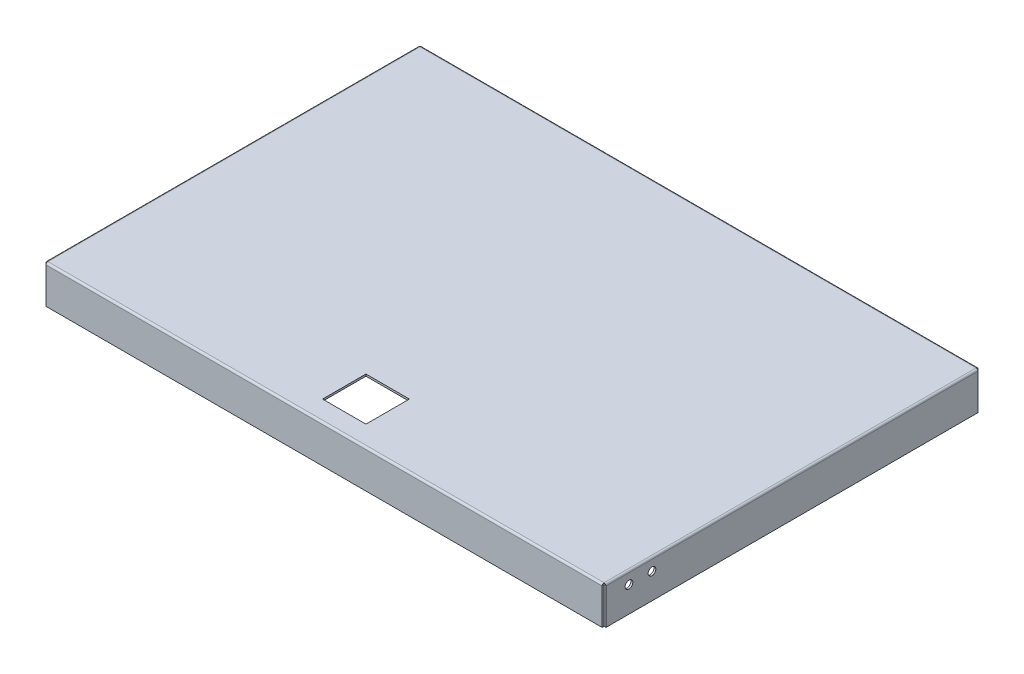
ISO-10303-21;
HEADER;
FILE_DESCRIPTION(('STEP AP214'),'2;1');
FILE_NAME('part.step','',(''),(''),'','','');
FILE_SCHEMA(('AUTOMOTIVE_DESIGN { 1 0 10303 214 1 1 1 1 }'));
ENDSEC;
DATA;
#1=APPLICATION_CONTEXT('core data for automotive mechanical design processes');
#2=APPLICATION_PROTOCOL_DEFINITION('international standard','automotive_design',2000,#1);
#3=PRODUCT_CONTEXT('',#1,'mechanical');
#4=PRODUCT('Part','Part','',(#3));
#5=PRODUCT_RELATED_PRODUCT_CATEGORY('part','',(#4));
#6=PRODUCT_DEFINITION_FORMATION('','',#4);
#7=PRODUCT_DEFINITION_CONTEXT('part definition',#1,'design');
#8=PRODUCT_DEFINITION('design','',#6,#7);
#9=PRODUCT_DEFINITION_SHAPE('','',#8);
#10=(LENGTH_UNIT() NAMED_UNIT(*) SI_UNIT(.MILLI.,.METRE.));
#11=(NAMED_UNIT(*) PLANE_ANGLE_UNIT() SI_UNIT($,.RADIAN.));
#12=(NAMED_UNIT(*) SI_UNIT($,.STERADIAN.) SOLID_ANGLE_UNIT());
#13=UNCERTAINTY_MEASURE_WITH_UNIT(LENGTH_MEASURE(1.E-05),#10,'distance_accuracy_value','');
#14=(GEOMETRIC_REPRESENTATION_CONTEXT(3) GLOBAL_UNCERTAINTY_ASSIGNED_CONTEXT((#13)) GLOBAL_UNIT_ASSIGNED_CONTEXT((#10,
#11,#12)) REPRESENTATION_CONTEXT('',''));
#15=CARTESIAN_POINT('',(0.,0.,0.));
#16=DIRECTION('',(0.,0.,1.));
#17=DIRECTION('',(1.,0.,0.));
#18=AXIS2_PLACEMENT_3D('',#15,#16,#17);
#19=CARTESIAN_POINT('',(923.925,59.4,0.));
#20=DIRECTION('',(-1.,0.,0.));
#21=DIRECTION('',(0.,0.,1.));
#22=AXIS2_PLACEMENT_3D('',#19,#20,#21);
#23=PLANE('',#22);
#24=CARTESIAN_POINT('',(923.925,42.4,-38.1));
#25=DIRECTION('',(1.,0.,0.));
#26=DIRECTION('',(0.,0.,-1.));
#27=AXIS2_PLACEMENT_3D('',#24,#25,#26);
#28=CIRCLE('',#27,6.35000000000001);
#29=CARTESIAN_POINT('',(923.925,42.4,-44.45));
#30=VERTEX_POINT('',#29);
#31=EDGE_CURVE('E126',#30,#30,#28,.T.);
#32=ORIENTED_EDGE('',*,*,#31,.F.);
#33=EDGE_LOOP('',(#32));
#34=FACE_BOUND('',#33,.T.);
#35=CARTESIAN_POINT('',(923.925,42.4,-76.2));
#36=DIRECTION('',(1.,0.,0.));
#37=DIRECTION('',(0.,0.,-1.));
#38=AXIS2_PLACEMENT_3D('',#35,#36,#37);
#39=CIRCLE('',#38,6.35000000000001);
#40=CARTESIAN_POINT('',(923.925,42.4,-82.55));
#41=VERTEX_POINT('',#40);
#42=EDGE_CURVE('E127',#41,#41,#39,.T.);
#43=ORIENTED_EDGE('',*,*,#42,.F.);
#44=EDGE_LOOP('',(#43));
#45=FACE_BOUND('',#44,.T.);
#46=DIRECTION('',(0.,0.,-1.));
#47=VECTOR('',#46,1.);
#48=CARTESIAN_POINT('',(923.925,0.,0.));
#49=LINE('',#48,#47);
#50=CARTESIAN_POINT('',(923.925,0.,0.));
#51=VERTEX_POINT('',#50);
#52=CARTESIAN_POINT('',(923.925,0.,-615.95));
#53=VERTEX_POINT('',#52);
#54=EDGE_CURVE('E111',#51,#53,#49,.T.);
#55=ORIENTED_EDGE('',*,*,#54,.T.);
#56=DIRECTION('',(0.,-1.,0.));
#57=VECTOR('',#56,1.);
#58=CARTESIAN_POINT('',(923.925,59.4,-615.95));
#59=LINE('',#58,#57);
#60=CARTESIAN_POINT('',(923.925,59.4,-615.95));
#61=VERTEX_POINT('',#60);
#62=EDGE_CURVE('E12',#61,#53,#59,.T.);
#63=ORIENTED_EDGE('',*,*,#62,.F.);
#64=DIRECTION('',(0.,0.,-1.));
#65=VECTOR('',#64,1.);
#66=CARTESIAN_POINT('',(923.925,59.4,0.));
#67=LINE('',#66,#65);
#68=CARTESIAN_POINT('',(923.925,59.4,0.));
#69=VERTEX_POINT('',#68);
#70=EDGE_CURVE('E97',#69,#61,#67,.T.);
#71=ORIENTED_EDGE('',*,*,#70,.F.);
#72=DIRECTION('',(0.,-1.,0.));
#73=VECTOR('',#72,1.);
#74=CARTESIAN_POINT('',(923.925,59.4,0.));
#75=LINE('',#74,#73);
#76=EDGE_CURVE('E64',#69,#51,#75,.T.);
#77=ORIENTED_EDGE('',*,*,#76,.T.);
#78=EDGE_LOOP('',(#55,#63,#71,#77));
#79=FACE_BOUND('',#78,.T.);
#80=ADVANCED_FACE('F48',(#34,#45,#79),#23,.F.);
#81=CARTESIAN_POINT('',(0.,59.4,-615.95));
#82=DIRECTION('',(0.,0.,1.));
#83=DIRECTION('',(1.,0.,0.));
#84=AXIS2_PLACEMENT_3D('',#81,#82,#83);
#85=PLANE('',#84);
#86=DIRECTION('',(-1.,0.,0.));
#87=VECTOR('',#86,1.);
#88=CARTESIAN_POINT('',(0.,0.,-615.95));
#89=LINE('',#88,#87);
#90=CARTESIAN_POINT('',(920.75,0.,-615.95));
#91=VERTEX_POINT('',#90);
#92=EDGE_CURVE('E102',#53,#91,#89,.T.);
#93=ORIENTED_EDGE('',*,*,#92,.T.);
#94=DIRECTION('',(0.,-1.,0.));
#95=VECTOR('',#94,1.);
#96=CARTESIAN_POINT('',(920.75,59.4,-615.95));
#97=LINE('',#96,#95);
#98=CARTESIAN_POINT('',(920.75,59.4,-615.95));
#99=VERTEX_POINT('',#98);
#100=EDGE_CURVE('E56',#99,#91,#97,.T.);
#101=ORIENTED_EDGE('',*,*,#100,.F.);
#102=DIRECTION('',(-1.,0.,0.));
#103=VECTOR('',#102,1.);
#104=CARTESIAN_POINT('',(0.,59.4,-615.95));
#105=LINE('',#104,#103);
#106=EDGE_CURVE('E89',#61,#99,#105,.T.);
#107=ORIENTED_EDGE('',*,*,#106,.F.);
#108=ORIENTED_EDGE('',*,*,#62,.T.);
#109=EDGE_LOOP('',(#93,#101,#107,#108));
#110=FACE_BOUND('',#109,.T.);
#111=ADVANCED_FACE('F101',(#110),#85,.F.);
#112=CARTESIAN_POINT('',(920.75,59.4,0.));
#113=DIRECTION('',(-1.,0.,0.));
#114=DIRECTION('',(0.,0.,1.));
#115=AXIS2_PLACEMENT_3D('',#112,#113,#114);
#116=PLANE('',#115);
#117=CARTESIAN_POINT('',(920.75,42.4,-38.1));
#118=DIRECTION('',(-1.,0.,0.));
#119=DIRECTION('',(0.,0.,1.));
#120=AXIS2_PLACEMENT_3D('',#117,#118,#119);
#121=CIRCLE('',#120,6.35000000000001);
#122=CARTESIAN_POINT('',(920.75,42.4,-31.75));
#123=VERTEX_POINT('',#122);
#124=EDGE_CURVE('E113',#123,#123,#121,.F.);
#125=ORIENTED_EDGE('',*,*,#124,.T.);
#126=EDGE_LOOP('',(#125));
#127=FACE_BOUND('',#126,.T.);
#128=CARTESIAN_POINT('',(920.75,42.4,-76.2));
#129=DIRECTION('',(-1.,0.,0.));
#130=DIRECTION('',(0.,0.,1.));
#131=AXIS2_PLACEMENT_3D('',#128,#129,#130);
#132=CIRCLE('',#131,6.35000000000001);
#133=CARTESIAN_POINT('',(920.75,42.4,-69.85));
#134=VERTEX_POINT('',#133);
#135=EDGE_CURVE('E123',#134,#134,#132,.F.);
#136=ORIENTED_EDGE('',*,*,#135,.T.);
#137=EDGE_LOOP('',(#136));
#138=FACE_BOUND('',#137,.T.);
#139=DIRECTION('',(0.,0.,-1.));
#140=VECTOR('',#139,1.);
#141=CARTESIAN_POINT('',(920.75,0.,0.));
#142=LINE('',#141,#140);
#143=CARTESIAN_POINT('',(920.75,0.,0.));
#144=VERTEX_POINT('',#143);
#145=EDGE_CURVE('E115',#144,#91,#142,.T.);
#146=ORIENTED_EDGE('',*,*,#145,.F.);
#147=DIRECTION('',(0.,-1.,0.));
#148=VECTOR('',#147,1.);
#149=CARTESIAN_POINT('',(920.75,59.4,0.));
#150=LINE('',#149,#148);
#151=CARTESIAN_POINT('',(920.75,59.4,0.));
#152=VERTEX_POINT('',#151);
#153=EDGE_CURVE('E78',#152,#144,#150,.T.);
#154=ORIENTED_EDGE('',*,*,#153,.F.);
#155=DIRECTION('',(0.,0.,-1.));
#156=VECTOR('',#155,1.);
#157=CARTESIAN_POINT('',(920.75,59.4,0.));
#158=LINE('',#157,#156);
#159=EDGE_CURVE('E96',#152,#99,#158,.T.);
#160=ORIENTED_EDGE('',*,*,#159,.T.);
#161=ORIENTED_EDGE('',*,*,#100,.T.);
#162=EDGE_LOOP('',(#146,#154,#160,#161));
#163=FACE_BOUND('',#162,.T.);
#164=ADVANCED_FACE('F105',(#127,#138,#163),#116,.T.);
#165=CARTESIAN_POINT('',(0.,59.4,0.));
#166=DIRECTION('',(0.,0.,1.));
#167=DIRECTION('',(1.,0.,0.));
#168=AXIS2_PLACEMENT_3D('',#165,#166,#167);
#169=PLANE('',#168);
#170=DIRECTION('',(-1.,0.,0.));
#171=VECTOR('',#170,1.);
#172=CARTESIAN_POINT('',(0.,0.,0.));
#173=LINE('',#172,#171);
#174=EDGE_CURVE('E117',#51,#144,#173,.T.);
#175=ORIENTED_EDGE('',*,*,#174,.F.);
#176=ORIENTED_EDGE('',*,*,#76,.F.);
#177=DIRECTION('',(-1.,0.,0.));
#178=VECTOR('',#177,1.);
#179=CARTESIAN_POINT('',(0.,59.4,0.));
#180=LINE('',#179,#178);
#181=EDGE_CURVE('E106',#69,#152,#180,.T.);
#182=ORIENTED_EDGE('',*,*,#181,.T.);
#183=ORIENTED_EDGE('',*,*,#153,.T.);
#184=EDGE_LOOP('',(#175,#176,#182,#183));
#185=FACE_BOUND('',#184,.T.);
#186=ADVANCED_FACE('F142',(#185),#169,.T.);
#187=CARTESIAN_POINT('',(0.,59.4,0.));
#188=DIRECTION('',(0.,1.,0.));
#189=DIRECTION('',(0.,0.,1.));
#190=AXIS2_PLACEMENT_3D('',#187,#188,#189);
#191=PLANE('',#190);
#192=ORIENTED_EDGE('',*,*,#70,.T.);
#193=ORIENTED_EDGE('',*,*,#106,.T.);
#194=ORIENTED_EDGE('',*,*,#159,.F.);
#195=ORIENTED_EDGE('',*,*,#181,.F.);
#196=EDGE_LOOP('',(#192,#193,#194,#195));
#197=FACE_BOUND('',#196,.T.);
#198=ADVANCED_FACE('F93',(#197),#191,.T.);
#199=CARTESIAN_POINT('',(0.,0.,0.));
#200=DIRECTION('',(0.,1.,0.));
#201=DIRECTION('',(0.,0.,1.));
#202=AXIS2_PLACEMENT_3D('',#199,#200,#201);
#203=PLANE('',#202);
#204=ORIENTED_EDGE('',*,*,#54,.F.);
#205=ORIENTED_EDGE('',*,*,#174,.T.);
#206=ORIENTED_EDGE('',*,*,#145,.T.);
#207=ORIENTED_EDGE('',*,*,#92,.F.);
#208=EDGE_LOOP('',(#204,#205,#206,#207));
#209=FACE_BOUND('',#208,.T.);
#210=ADVANCED_FACE('F141',(#209),#203,.F.);
#211=CARTESIAN_POINT('',(902.789487757862,42.4,-76.2));
#212=DIRECTION('',(1.,0.,0.));
#213=DIRECTION('',(0.,0.,-1.));
#214=AXIS2_PLACEMENT_3D('',#211,#212,#213);
#215=CYLINDRICAL_SURFACE('',#214,6.35000000000001);
#216=ORIENTED_EDGE('',*,*,#42,.T.);
#217=EDGE_LOOP('',(#216));
#218=FACE_BOUND('',#217,.T.);
#219=ORIENTED_EDGE('',*,*,#135,.F.);
#220=EDGE_LOOP('',(#219));
#221=FACE_BOUND('',#220,.T.);
#222=ADVANCED_FACE('F172',(#218,#221),#215,.F.);
#223=CARTESIAN_POINT('',(902.789487757862,42.4,-38.1));
#224=DIRECTION('',(1.,0.,0.));
#225=DIRECTION('',(0.,0.,-1.));
#226=AXIS2_PLACEMENT_3D('',#223,#224,#225);
#227=CYLINDRICAL_SURFACE('',#226,6.35000000000001);
#228=ORIENTED_EDGE('',*,*,#31,.T.);
#229=EDGE_LOOP('',(#228));
#230=FACE_BOUND('',#229,.T.);
#231=ORIENTED_EDGE('',*,*,#124,.F.);
#232=EDGE_LOOP('',(#231));
#233=FACE_BOUND('',#232,.T.);
#234=ADVANCED_FACE('F135',(#230,#233),#227,.F.);
#235=CLOSED_SHELL('',(#80,#111,#164,#186,#198,#210,#222,#234));
#236=MANIFOLD_SOLID_BREP('B2',#235);
#237=CARTESIAN_POINT('',(920.75,59.4,0.));
#238=DIRECTION('',(1.,0.,0.));
#239=DIRECTION('',(0.,0.,-1.));
#240=AXIS2_PLACEMENT_3D('',#237,#238,#239);
#241=PLANE('',#240);
#242=DIRECTION('',(0.,0.,1.));
#243=VECTOR('',#242,1.);
#244=CARTESIAN_POINT('',(920.75,0.,0.));
#245=LINE('',#244,#243);
#246=CARTESIAN_POINT('',(920.75,0.,-619.125));
#247=VERTEX_POINT('',#246);
#248=CARTESIAN_POINT('',(920.75,0.,-615.95));
#249=VERTEX_POINT('',#248);
#250=EDGE_CURVE('E289',#247,#249,#245,.T.);
#251=ORIENTED_EDGE('',*,*,#250,.F.);
#252=DIRECTION('',(0.,-1.,0.));
#253=VECTOR('',#252,1.);
#254=CARTESIAN_POINT('',(920.75,59.4,-619.125));
#255=LINE('',#254,#253);
#256=CARTESIAN_POINT('',(920.75,59.4,-619.125));
#257=VERTEX_POINT('',#256);
#258=EDGE_CURVE('E46',#257,#247,#255,.T.);
#259=ORIENTED_EDGE('',*,*,#258,.F.);
#260=DIRECTION('',(0.,0.,1.));
#261=VECTOR('',#260,1.);
#262=CARTESIAN_POINT('',(920.75,59.4,0.));
#263=LINE('',#262,#261);
#264=CARTESIAN_POINT('',(920.75,59.4,-615.95));
#265=VERTEX_POINT('',#264);
#266=EDGE_CURVE('E283',#257,#265,#263,.T.);
#267=ORIENTED_EDGE('',*,*,#266,.T.);
#268=DIRECTION('',(0.,-1.,0.));
#269=VECTOR('',#268,1.);
#270=CARTESIAN_POINT('',(920.75,59.4,-615.95));
#271=LINE('',#270,#269);
#272=EDGE_CURVE('E264',#265,#249,#271,.T.);
#273=ORIENTED_EDGE('',*,*,#272,.T.);
#274=EDGE_LOOP('',(#251,#259,#267,#273));
#275=FACE_BOUND('',#274,.T.);
#276=ADVANCED_FACE('F226',(#275),#241,.T.);
#277=CARTESIAN_POINT('',(0.,59.4,-619.125));
#278=DIRECTION('',(0.,0.,-1.));
#279=DIRECTION('',(-1.,0.,0.));
#280=AXIS2_PLACEMENT_3D('',#277,#278,#279);
#281=PLANE('',#280);
#282=DIRECTION('',(1.,0.,0.));
#283=VECTOR('',#282,1.);
#284=CARTESIAN_POINT('',(0.,0.,-619.125));
#285=LINE('',#284,#283);
#286=CARTESIAN_POINT('',(0.,0.,-619.125));
#287=VERTEX_POINT('',#286);
#288=EDGE_CURVE('E277',#287,#247,#285,.T.);
#289=ORIENTED_EDGE('',*,*,#288,.F.);
#290=DIRECTION('',(0.,-1.,0.));
#291=VECTOR('',#290,1.);
#292=CARTESIAN_POINT('',(0.,59.4,-619.125));
#293=LINE('',#292,#291);
#294=CARTESIAN_POINT('',(0.,59.4,-619.125));
#295=VERTEX_POINT('',#294);
#296=EDGE_CURVE('E234',#295,#287,#293,.T.);
#297=ORIENTED_EDGE('',*,*,#296,.F.);
#298=DIRECTION('',(1.,0.,0.));
#299=VECTOR('',#298,1.);
#300=CARTESIAN_POINT('',(0.,59.4,-619.125));
#301=LINE('',#300,#299);
#302=EDGE_CURVE('E275',#295,#257,#301,.T.);
#303=ORIENTED_EDGE('',*,*,#302,.T.);
#304=ORIENTED_EDGE('',*,*,#258,.T.);
#305=EDGE_LOOP('',(#289,#297,#303,#304));
#306=FACE_BOUND('',#305,.T.);
#307=ADVANCED_FACE('F273',(#306),#281,.T.);
#308=CARTESIAN_POINT('',(0.,59.4,0.));
#309=DIRECTION('',(1.,0.,0.));
#310=DIRECTION('',(0.,0.,-1.));
#311=AXIS2_PLACEMENT_3D('',#308,#309,#310);
#312=PLANE('',#311);
#313=DIRECTION('',(0.,0.,1.));
#314=VECTOR('',#313,1.);
#315=CARTESIAN_POINT('',(0.,0.,0.));
#316=LINE('',#315,#314);
#317=CARTESIAN_POINT('',(0.,0.,-615.95));
#318=VERTEX_POINT('',#317);
#319=EDGE_CURVE('E257',#287,#318,#316,.T.);
#320=ORIENTED_EDGE('',*,*,#319,.T.);
#321=DIRECTION('',(0.,-1.,0.));
#322=VECTOR('',#321,1.);
#323=CARTESIAN_POINT('',(0.,59.4,-615.95));
#324=LINE('',#323,#322);
#325=CARTESIAN_POINT('',(0.,59.4,-615.95));
#326=VERTEX_POINT('',#325);
#327=EDGE_CURVE('E278',#326,#318,#324,.T.);
#328=ORIENTED_EDGE('',*,*,#327,.F.);
#329=DIRECTION('',(0.,0.,1.));
#330=VECTOR('',#329,1.);
#331=CARTESIAN_POINT('',(0.,59.4,0.));
#332=LINE('',#331,#330);
#333=EDGE_CURVE('E279',#295,#326,#332,.T.);
#334=ORIENTED_EDGE('',*,*,#333,.F.);
#335=ORIENTED_EDGE('',*,*,#296,.T.);
#336=EDGE_LOOP('',(#320,#328,#334,#335));
#337=FACE_BOUND('',#336,.T.);
#338=ADVANCED_FACE('F280',(#337),#312,.F.);
#339=CARTESIAN_POINT('',(0.,59.4,-615.95));
#340=DIRECTION('',(0.,0.,-1.));
#341=DIRECTION('',(-1.,0.,0.));
#342=AXIS2_PLACEMENT_3D('',#339,#340,#341);
#343=PLANE('',#342);
#344=DIRECTION('',(1.,0.,0.));
#345=VECTOR('',#344,1.);
#346=CARTESIAN_POINT('',(0.,0.,-615.95));
#347=LINE('',#346,#345);
#348=EDGE_CURVE('E285',#318,#249,#347,.T.);
#349=ORIENTED_EDGE('',*,*,#348,.T.);
#350=ORIENTED_EDGE('',*,*,#272,.F.);
#351=DIRECTION('',(1.,0.,0.));
#352=VECTOR('',#351,1.);
#353=CARTESIAN_POINT('',(0.,59.4,-615.95));
#354=LINE('',#353,#352);
#355=EDGE_CURVE('E242',#326,#265,#354,.T.);
#356=ORIENTED_EDGE('',*,*,#355,.F.);
#357=ORIENTED_EDGE('',*,*,#327,.T.);
#358=EDGE_LOOP('',(#349,#350,#356,#357));
#359=FACE_BOUND('',#358,.T.);
#360=ADVANCED_FACE('F298',(#359),#343,.F.);
#361=CARTESIAN_POINT('',(0.,59.4,0.));
#362=DIRECTION('',(0.,1.,0.));
#363=DIRECTION('',(0.,0.,1.));
#364=AXIS2_PLACEMENT_3D('',#361,#362,#363);
#365=PLANE('',#364);
#366=ORIENTED_EDGE('',*,*,#266,.F.);
#367=ORIENTED_EDGE('',*,*,#302,.F.);
#368=ORIENTED_EDGE('',*,*,#333,.T.);
#369=ORIENTED_EDGE('',*,*,#355,.T.);
#370=EDGE_LOOP('',(#366,#367,#368,#369));
#371=FACE_BOUND('',#370,.T.);
#372=ADVANCED_FACE('F282',(#371),#365,.T.);
#373=CARTESIAN_POINT('',(0.,0.,0.));
#374=DIRECTION('',(0.,1.,0.));
#375=DIRECTION('',(0.,0.,1.));
#376=AXIS2_PLACEMENT_3D('',#373,#374,#375);
#377=PLANE('',#376);
#378=ORIENTED_EDGE('',*,*,#250,.T.);
#379=ORIENTED_EDGE('',*,*,#348,.F.);
#380=ORIENTED_EDGE('',*,*,#319,.F.);
#381=ORIENTED_EDGE('',*,*,#288,.T.);
#382=EDGE_LOOP('',(#378,#379,#380,#381));
#383=FACE_BOUND('',#382,.T.);
#384=ADVANCED_FACE('F300',(#383),#377,.F.);
#385=CLOSED_SHELL('',(#276,#307,#338,#360,#372,#384));
#386=MANIFOLD_SOLID_BREP('B6',#385);
#387=CARTESIAN_POINT('',(0.,59.4,0.));
#388=DIRECTION('',(0.,0.,1.));
#389=DIRECTION('',(1.,0.,0.));
#390=AXIS2_PLACEMENT_3D('',#387,#388,#389);
#391=PLANE('',#390);
#392=DIRECTION('',(0.,-1.,0.));
#393=VECTOR('',#392,1.);
#394=CARTESIAN_POINT('',(0.,62.575,0.));
#395=LINE('',#394,#393);
#396=CARTESIAN_POINT('',(0.,62.575,0.));
#397=VERTEX_POINT('',#396);
#398=CARTESIAN_POINT('',(0.,59.4,0.));
#399=VERTEX_POINT('',#398);
#400=EDGE_CURVE('E532',#397,#399,#395,.T.);
#401=ORIENTED_EDGE('',*,*,#400,.F.);
#402=CARTESIAN_POINT('',(0.,59.4,0.));
#403=DIRECTION('',(0.,0.,1.));
#404=DIRECTION('',(1.,0.,0.));
#405=AXIS2_PLACEMENT_3D('',#402,#403,#404);
#406=CIRCLE('',#405,3.175);
#407=CARTESIAN_POINT('',(-3.175,59.4,0.));
#408=VERTEX_POINT('',#407);
#409=EDGE_CURVE('E482',#397,#408,#406,.T.);
#410=ORIENTED_EDGE('',*,*,#409,.T.);
#411=DIRECTION('',(0.,-1.,0.));
#412=VECTOR('',#411,1.);
#413=CARTESIAN_POINT('',(-3.175,59.4,0.));
#414=LINE('',#413,#412);
#415=CARTESIAN_POINT('',(-3.175,0.,0.));
#416=VERTEX_POINT('',#415);
#417=EDGE_CURVE('E517',#408,#416,#414,.T.);
#418=ORIENTED_EDGE('',*,*,#417,.T.);
#419=DIRECTION('',(-1.,0.,0.));
#420=VECTOR('',#419,1.);
#421=CARTESIAN_POINT('',(0.,0.,0.));
#422=LINE('',#421,#420);
#423=CARTESIAN_POINT('',(0.,0.,0.));
#424=VERTEX_POINT('',#423);
#425=EDGE_CURVE('E529',#424,#416,#422,.T.);
#426=ORIENTED_EDGE('',*,*,#425,.F.);
#427=DIRECTION('',(0.,-1.,0.));
#428=VECTOR('',#427,1.);
#429=CARTESIAN_POINT('',(0.,59.4,0.));
#430=LINE('',#429,#428);
#431=EDGE_CURVE('E511',#399,#424,#430,.T.);
#432=ORIENTED_EDGE('',*,*,#431,.F.);
#433=EDGE_LOOP('',(#401,#410,#418,#426,#432));
#434=FACE_BOUND('',#433,.T.);
#435=ADVANCED_FACE('F359',(#434),#391,.T.);
#436=CARTESIAN_POINT('',(0.,59.4,0.));
#437=DIRECTION('',(-1.,0.,0.));
#438=DIRECTION('',(0.,0.,1.));
#439=AXIS2_PLACEMENT_3D('',#436,#437,#438);
#440=PLANE('',#439);
#441=DIRECTION('',(0.,0.,-1.));
#442=VECTOR('',#441,1.);
#443=CARTESIAN_POINT('',(0.,0.,0.));
#444=LINE('',#443,#442);
#445=CARTESIAN_POINT('',(0.,0.,-615.95));
#446=VERTEX_POINT('',#445);
#447=EDGE_CURVE('E526',#424,#446,#444,.T.);
#448=ORIENTED_EDGE('',*,*,#447,.T.);
#449=DIRECTION('',(0.,-1.,0.));
#450=VECTOR('',#449,1.);
#451=CARTESIAN_POINT('',(0.,59.4,-615.95));
#452=LINE('',#451,#450);
#453=CARTESIAN_POINT('',(0.,59.4,-615.95));
#454=VERTEX_POINT('',#453);
#455=EDGE_CURVE('E513',#454,#446,#452,.T.);
#456=ORIENTED_EDGE('',*,*,#455,.F.);
#457=DIRECTION('',(0.,0.,-1.));
#458=VECTOR('',#457,1.);
#459=CARTESIAN_POINT('',(0.,59.4,0.));
#460=LINE('',#459,#458);
#461=EDGE_CURVE('E519',#399,#454,#460,.T.);
#462=ORIENTED_EDGE('',*,*,#461,.F.);
#463=ORIENTED_EDGE('',*,*,#431,.T.);
#464=EDGE_LOOP('',(#448,#456,#462,#463));
#465=FACE_BOUND('',#464,.T.);
#466=ADVANCED_FACE('F645',(#465),#440,.F.);
#467=CARTESIAN_POINT('',(0.,59.4,-615.95));
#468=DIRECTION('',(0.,0.,-1.));
#469=DIRECTION('',(-1.,0.,0.));
#470=AXIS2_PLACEMENT_3D('',#467,#468,#469);
#471=PLANE('',#470);
#472=DIRECTION('',(0.,-1.,0.));
#473=VECTOR('',#472,1.);
#474=CARTESIAN_POINT('',(-3.175,59.4,-615.95));
#475=LINE('',#474,#473);
#476=CARTESIAN_POINT('',(-3.175,59.4,-615.95));
#477=VERTEX_POINT('',#476);
#478=CARTESIAN_POINT('',(-3.175,0.,-615.95));
#479=VERTEX_POINT('',#478);
#480=EDGE_CURVE('E515',#477,#479,#475,.T.);
#481=ORIENTED_EDGE('',*,*,#480,.F.);
#482=CARTESIAN_POINT('',(0.,59.4,-615.95));
#483=DIRECTION('',(0.,0.,-1.));
#484=DIRECTION('',(-1.,0.,0.));
#485=AXIS2_PLACEMENT_3D('',#482,#483,#484);
#486=CIRCLE('',#485,3.175);
#487=CARTESIAN_POINT('',(0.,62.575,-615.95));
#488=VERTEX_POINT('',#487);
#489=EDGE_CURVE('E462',#477,#488,#486,.T.);
#490=ORIENTED_EDGE('',*,*,#489,.T.);
#491=DIRECTION('',(0.,-1.,0.));
#492=VECTOR('',#491,1.);
#493=CARTESIAN_POINT('',(0.,62.575,-615.95));
#494=LINE('',#493,#492);
#495=EDGE_CURVE('E543',#488,#454,#494,.T.);
#496=ORIENTED_EDGE('',*,*,#495,.T.);
#497=ORIENTED_EDGE('',*,*,#455,.T.);
#498=DIRECTION('',(1.,0.,0.));
#499=VECTOR('',#498,1.);
#500=CARTESIAN_POINT('',(0.,0.,-615.95));
#501=LINE('',#500,#499);
#502=EDGE_CURVE('E523',#479,#446,#501,.T.);
#503=ORIENTED_EDGE('',*,*,#502,.F.);
#504=EDGE_LOOP('',(#481,#490,#496,#497,#503));
#505=FACE_BOUND('',#504,.T.);
#506=ADVANCED_FACE('F641',(#505),#471,.T.);
#507=CARTESIAN_POINT('',(-3.175,59.4,0.));
#508=DIRECTION('',(-1.,0.,0.));
#509=DIRECTION('',(0.,0.,1.));
#510=AXIS2_PLACEMENT_3D('',#507,#508,#509);
#511=PLANE('',#510);
#512=ORIENTED_EDGE('',*,*,#417,.F.);
#513=DIRECTION('',(0.,0.,1.));
#514=VECTOR('',#513,1.);
#515=CARTESIAN_POINT('',(-3.175,59.4,0.));
#516=LINE('',#515,#514);
#517=EDGE_CURVE('E480',#408,#477,#516,.F.);
#518=ORIENTED_EDGE('',*,*,#517,.T.);
#519=ORIENTED_EDGE('',*,*,#480,.T.);
#520=DIRECTION('',(0.,0.,-1.));
#521=VECTOR('',#520,1.);
#522=CARTESIAN_POINT('',(-3.175,0.,0.));
#523=LINE('',#522,#521);
#524=EDGE_CURVE('E520',#416,#479,#523,.T.);
#525=ORIENTED_EDGE('',*,*,#524,.F.);
#526=EDGE_LOOP('',(#512,#518,#519,#525));
#527=FACE_BOUND('',#526,.T.);
#528=ADVANCED_FACE('F638',(#527),#511,.T.);
#529=CARTESIAN_POINT('',(0.,0.,0.));
#530=DIRECTION('',(0.,1.,0.));
#531=DIRECTION('',(0.,0.,1.));
#532=AXIS2_PLACEMENT_3D('',#529,#530,#531);
#533=PLANE('',#532);
#534=ORIENTED_EDGE('',*,*,#425,.T.);
#535=ORIENTED_EDGE('',*,*,#524,.T.);
#536=ORIENTED_EDGE('',*,*,#502,.T.);
#537=ORIENTED_EDGE('',*,*,#447,.F.);
#538=EDGE_LOOP('',(#534,#535,#536,#537));
#539=FACE_BOUND('',#538,.T.);
#540=ADVANCED_FACE('F591',(#539),#533,.F.);
#541=CARTESIAN_POINT('',(0.,59.4,0.));
#542=DIRECTION('',(0.,1.,0.));
#543=DIRECTION('',(0.,0.,1.));
#544=AXIS2_PLACEMENT_3D('',#541,#542,#543);
#545=PLANE('',#544);
#546=DIRECTION('',(-1.,0.,0.));
#547=VECTOR('',#546,1.);
#548=CARTESIAN_POINT('',(0.,59.4,-102.108));
#549=LINE('',#548,#547);
#550=CARTESIAN_POINT('',(496.316,59.4,-102.108));
#551=VERTEX_POINT('',#550);
#552=CARTESIAN_POINT('',(424.434,59.4,-102.108));
#553=VERTEX_POINT('',#552);
#554=EDGE_CURVE('E571',#551,#553,#549,.T.);
#555=ORIENTED_EDGE('',*,*,#554,.T.);
#556=DIRECTION('',(0.,0.,1.));
#557=VECTOR('',#556,1.);
#558=CARTESIAN_POINT('',(424.434,59.4,0.));
#559=LINE('',#558,#557);
#560=CARTESIAN_POINT('',(424.434,59.4,-30.226));
#561=VERTEX_POINT('',#560);
#562=EDGE_CURVE('E568',#553,#561,#559,.T.);
#563=ORIENTED_EDGE('',*,*,#562,.T.);
#564=DIRECTION('',(1.,0.,0.));
#565=VECTOR('',#564,1.);
#566=CARTESIAN_POINT('',(0.,59.4,-30.226));
#567=LINE('',#566,#565);
#568=CARTESIAN_POINT('',(496.316,59.4,-30.226));
#569=VERTEX_POINT('',#568);
#570=EDGE_CURVE('E575',#561,#569,#567,.T.);
#571=ORIENTED_EDGE('',*,*,#570,.T.);
#572=DIRECTION('',(0.,0.,-1.));
#573=VECTOR('',#572,1.);
#574=CARTESIAN_POINT('',(496.316,59.4,0.));
#575=LINE('',#574,#573);
#576=EDGE_CURVE('E469',#569,#551,#575,.T.);
#577=ORIENTED_EDGE('',*,*,#576,.T.);
#578=EDGE_LOOP('',(#555,#563,#571,#577));
#579=FACE_BOUND('',#578,.T.);
#580=DIRECTION('',(0.,0.,1.));
#581=VECTOR('',#580,1.);
#582=CARTESIAN_POINT('',(0.,59.4,0.));
#583=LINE('',#582,#581);
#584=CARTESIAN_POINT('',(0.,59.4,3.175));
#585=VERTEX_POINT('',#584);
#586=EDGE_CURVE('E566',#399,#585,#583,.T.);
#587=ORIENTED_EDGE('',*,*,#586,.F.);
#588=ORIENTED_EDGE('',*,*,#461,.T.);
#589=DIRECTION('',(0.,0.,1.));
#590=VECTOR('',#589,1.);
#591=CARTESIAN_POINT('',(0.,59.4,-615.95));
#592=LINE('',#591,#590);
#593=CARTESIAN_POINT('',(0.,59.4,-619.125));
#594=VERTEX_POINT('',#593);
#595=EDGE_CURVE('E546',#594,#454,#592,.T.);
#596=ORIENTED_EDGE('',*,*,#595,.F.);
#597=DIRECTION('',(-1.,0.,0.));
#598=VECTOR('',#597,1.);
#599=CARTESIAN_POINT('',(0.,59.4,-619.125));
#600=LINE('',#599,#598);
#601=CARTESIAN_POINT('',(920.75,59.4,-619.125));
#602=VERTEX_POINT('',#601);
#603=EDGE_CURVE('E549',#602,#594,#600,.T.);
#604=ORIENTED_EDGE('',*,*,#603,.F.);
#605=DIRECTION('',(0.,0.,-1.));
#606=VECTOR('',#605,1.);
#607=CARTESIAN_POINT('',(920.75,59.4,-619.125));
#608=LINE('',#607,#606);
#609=CARTESIAN_POINT('',(920.75,59.4,-615.95));
#610=VERTEX_POINT('',#609);
#611=EDGE_CURVE('E552',#610,#602,#608,.T.);
#612=ORIENTED_EDGE('',*,*,#611,.F.);
#613=DIRECTION('',(-1.,0.,0.));
#614=VECTOR('',#613,1.);
#615=CARTESIAN_POINT('',(920.75,59.4,-615.95));
#616=LINE('',#615,#614);
#617=CARTESIAN_POINT('',(923.925,59.4,-615.95));
#618=VERTEX_POINT('',#617);
#619=EDGE_CURVE('E554',#618,#610,#616,.T.);
#620=ORIENTED_EDGE('',*,*,#619,.F.);
#621=DIRECTION('',(0.,0.,-1.));
#622=VECTOR('',#621,1.);
#623=CARTESIAN_POINT('',(923.925,59.4,0.));
#624=LINE('',#623,#622);
#625=CARTESIAN_POINT('',(923.925,59.4,0.));
#626=VERTEX_POINT('',#625);
#627=EDGE_CURVE('E556',#626,#618,#624,.T.);
#628=ORIENTED_EDGE('',*,*,#627,.F.);
#629=DIRECTION('',(1.,0.,0.));
#630=VECTOR('',#629,1.);
#631=CARTESIAN_POINT('',(920.75,59.4,0.));
#632=LINE('',#631,#630);
#633=CARTESIAN_POINT('',(920.75,59.4,0.));
#634=VERTEX_POINT('',#633);
#635=EDGE_CURVE('E559',#634,#626,#632,.T.);
#636=ORIENTED_EDGE('',*,*,#635,.F.);
#637=DIRECTION('',(0.,0.,-1.));
#638=VECTOR('',#637,1.);
#639=CARTESIAN_POINT('',(920.75,59.4,3.175));
#640=LINE('',#639,#638);
#641=CARTESIAN_POINT('',(920.75,59.4,3.175));
#642=VERTEX_POINT('',#641);
#643=EDGE_CURVE('E561',#642,#634,#640,.T.);
#644=ORIENTED_EDGE('',*,*,#643,.F.);
#645=DIRECTION('',(1.,0.,0.));
#646=VECTOR('',#645,1.);
#647=CARTESIAN_POINT('',(0.,59.4,3.175));
#648=LINE('',#647,#646);
#649=EDGE_CURVE('E563',#585,#642,#648,.T.);
#650=ORIENTED_EDGE('',*,*,#649,.F.);
#651=EDGE_LOOP('',(#587,#588,#596,#604,#612,#620,#628,#636,#644,#650));
#652=FACE_BOUND('',#651,.T.);
#653=ADVANCED_FACE('F587',(#579,#652),#545,.F.);
#654=CARTESIAN_POINT('',(0.,62.575,0.));
#655=DIRECTION('',(1.,0.,0.));
#656=DIRECTION('',(0.,0.,-1.));
#657=AXIS2_PLACEMENT_3D('',#654,#655,#656);
#658=PLANE('',#657);
#659=ORIENTED_EDGE('',*,*,#586,.T.);
#660=CARTESIAN_POINT('',(0.,59.4,0.));
#661=DIRECTION('',(1.,0.,0.));
#662=DIRECTION('',(0.,0.,-1.));
#663=AXIS2_PLACEMENT_3D('',#660,#661,#662);
#664=CIRCLE('',#663,3.175);
#665=EDGE_CURVE('E484',#585,#397,#664,.F.);
#666=ORIENTED_EDGE('',*,*,#665,.T.);
#667=ORIENTED_EDGE('',*,*,#400,.T.);
#668=EDGE_LOOP('',(#659,#666,#667));
#669=FACE_BOUND('',#668,.T.);
#670=ADVANCED_FACE('F590',(#669),#658,.F.);
#671=CARTESIAN_POINT('',(920.75,62.575,3.175));
#672=DIRECTION('',(-1.,0.,0.));
#673=DIRECTION('',(0.,0.,1.));
#674=AXIS2_PLACEMENT_3D('',#671,#672,#673);
#675=PLANE('',#674);
#676=DIRECTION('',(0.,-1.,0.));
#677=VECTOR('',#676,1.);
#678=CARTESIAN_POINT('',(920.75,62.575,0.));
#679=LINE('',#678,#677);
#680=CARTESIAN_POINT('',(920.75,62.575,0.));
#681=VERTEX_POINT('',#680);
#682=EDGE_CURVE('E537',#681,#634,#679,.T.);
#683=ORIENTED_EDGE('',*,*,#682,.F.);
#684=CARTESIAN_POINT('',(920.75,59.4,0.));
#685=DIRECTION('',(-1.,0.,0.));
#686=DIRECTION('',(0.,0.,1.));
#687=AXIS2_PLACEMENT_3D('',#684,#685,#686);
#688=CIRCLE('',#687,3.175);
#689=EDGE_CURVE('E487',#681,#642,#688,.F.);
#690=ORIENTED_EDGE('',*,*,#689,.T.);
#691=ORIENTED_EDGE('',*,*,#643,.T.);
#692=EDGE_LOOP('',(#683,#690,#691));
#693=FACE_BOUND('',#692,.T.);
#694=ADVANCED_FACE('F612',(#693),#675,.F.);
#695=CARTESIAN_POINT('',(920.75,62.575,0.));
#696=DIRECTION('',(0.,0.,-1.));
#697=DIRECTION('',(-1.,0.,0.));
#698=AXIS2_PLACEMENT_3D('',#695,#696,#697);
#699=PLANE('',#698);
#700=ORIENTED_EDGE('',*,*,#635,.T.);
#701=CARTESIAN_POINT('',(920.75,59.4,0.));
#702=DIRECTION('',(0.,0.,-1.));
#703=DIRECTION('',(-1.,0.,0.));
#704=AXIS2_PLACEMENT_3D('',#701,#702,#703);
#705=CIRCLE('',#704,3.175);
#706=EDGE_CURVE('E494',#626,#681,#705,.F.);
#707=ORIENTED_EDGE('',*,*,#706,.T.);
#708=ORIENTED_EDGE('',*,*,#682,.T.);
#709=EDGE_LOOP('',(#700,#707,#708));
#710=FACE_BOUND('',#709,.T.);
#711=ADVANCED_FACE('F683',(#710),#699,.F.);
#712=CARTESIAN_POINT('',(920.75,62.575,-615.95));
#713=DIRECTION('',(0.,0.,1.));
#714=DIRECTION('',(1.,0.,0.));
#715=AXIS2_PLACEMENT_3D('',#712,#713,#714);
#716=PLANE('',#715);
#717=DIRECTION('',(0.,-1.,0.));
#718=VECTOR('',#717,1.);
#719=CARTESIAN_POINT('',(920.75,62.575,-615.95));
#720=LINE('',#719,#718);
#721=CARTESIAN_POINT('',(920.75,62.575,-615.95));
#722=VERTEX_POINT('',#721);
#723=EDGE_CURVE('E540',#722,#610,#720,.T.);
#724=ORIENTED_EDGE('',*,*,#723,.F.);
#725=CARTESIAN_POINT('',(920.75,59.4,-615.95));
#726=DIRECTION('',(0.,0.,1.));
#727=DIRECTION('',(1.,0.,0.));
#728=AXIS2_PLACEMENT_3D('',#725,#726,#727);
#729=CIRCLE('',#728,3.175);
#730=EDGE_CURVE('E497',#722,#618,#729,.F.);
#731=ORIENTED_EDGE('',*,*,#730,.T.);
#732=ORIENTED_EDGE('',*,*,#619,.T.);
#733=EDGE_LOOP('',(#724,#731,#732));
#734=FACE_BOUND('',#733,.T.);
#735=ADVANCED_FACE('F680',(#734),#716,.F.);
#736=CARTESIAN_POINT('',(920.75,62.575,-619.125));
#737=DIRECTION('',(-1.,0.,0.));
#738=DIRECTION('',(0.,0.,1.));
#739=AXIS2_PLACEMENT_3D('',#736,#737,#738);
#740=PLANE('',#739);
#741=ORIENTED_EDGE('',*,*,#611,.T.);
#742=CARTESIAN_POINT('',(920.75,59.4,-615.95));
#743=DIRECTION('',(-1.,0.,0.));
#744=DIRECTION('',(0.,0.,1.));
#745=AXIS2_PLACEMENT_3D('',#742,#743,#744);
#746=CIRCLE('',#745,3.175);
#747=EDGE_CURVE('E489',#602,#722,#746,.F.);
#748=ORIENTED_EDGE('',*,*,#747,.T.);
#749=ORIENTED_EDGE('',*,*,#723,.T.);
#750=EDGE_LOOP('',(#741,#748,#749));
#751=FACE_BOUND('',#750,.T.);
#752=ADVANCED_FACE('F623',(#751),#740,.F.);
#753=CARTESIAN_POINT('',(0.,62.575,-615.95));
#754=DIRECTION('',(1.,0.,0.));
#755=DIRECTION('',(0.,0.,-1.));
#756=AXIS2_PLACEMENT_3D('',#753,#754,#755);
#757=PLANE('',#756);
#758=ORIENTED_EDGE('',*,*,#495,.F.);
#759=CARTESIAN_POINT('',(0.,59.4,-615.95));
#760=DIRECTION('',(1.,0.,0.));
#761=DIRECTION('',(0.,0.,-1.));
#762=AXIS2_PLACEMENT_3D('',#759,#760,#761);
#763=CIRCLE('',#762,3.175);
#764=EDGE_CURVE('E492',#488,#594,#763,.F.);
#765=ORIENTED_EDGE('',*,*,#764,.T.);
#766=ORIENTED_EDGE('',*,*,#595,.T.);
#767=EDGE_LOOP('',(#758,#765,#766));
#768=FACE_BOUND('',#767,.T.);
#769=ADVANCED_FACE('F631',(#768),#757,.F.);
#770=CARTESIAN_POINT('',(0.,62.575,0.));
#771=DIRECTION('',(0.,1.,0.));
#772=DIRECTION('',(0.,0.,1.));
#773=AXIS2_PLACEMENT_3D('',#770,#771,#772);
#774=PLANE('',#773);
#775=DIRECTION('',(0.,0.,1.));
#776=VECTOR('',#775,1.);
#777=CARTESIAN_POINT('',(424.434,62.575,0.));
#778=LINE('',#777,#776);
#779=CARTESIAN_POINT('',(424.434,62.575,-102.108));
#780=VERTEX_POINT('',#779);
#781=CARTESIAN_POINT('',(424.434,62.575,-30.226));
#782=VERTEX_POINT('',#781);
#783=EDGE_CURVE('E224',#780,#782,#778,.T.);
#784=ORIENTED_EDGE('',*,*,#783,.F.);
#785=DIRECTION('',(-1.,0.,0.));
#786=VECTOR('',#785,1.);
#787=CARTESIAN_POINT('',(0.,62.575,-102.108));
#788=LINE('',#787,#786);
#789=CARTESIAN_POINT('',(496.316,62.575,-102.108));
#790=VERTEX_POINT('',#789);
#791=EDGE_CURVE('E367',#790,#780,#788,.T.);
#792=ORIENTED_EDGE('',*,*,#791,.F.);
#793=DIRECTION('',(0.,0.,-1.));
#794=VECTOR('',#793,1.);
#795=CARTESIAN_POINT('',(496.316,62.575,0.));
#796=LINE('',#795,#794);
#797=CARTESIAN_POINT('',(496.316,62.575,-30.226));
#798=VERTEX_POINT('',#797);
#799=EDGE_CURVE('E461',#798,#790,#796,.T.);
#800=ORIENTED_EDGE('',*,*,#799,.F.);
#801=DIRECTION('',(1.,0.,0.));
#802=VECTOR('',#801,1.);
#803=CARTESIAN_POINT('',(0.,62.575,-30.226));
#804=LINE('',#803,#802);
#805=EDGE_CURVE('E456',#782,#798,#804,.T.);
#806=ORIENTED_EDGE('',*,*,#805,.F.);
#807=EDGE_LOOP('',(#784,#792,#800,#806));
#808=FACE_BOUND('',#807,.T.);
#809=DIRECTION('',(1.,0.,0.));
#810=VECTOR('',#809,1.);
#811=CARTESIAN_POINT('',(920.75,62.575,0.));
#812=LINE('',#811,#810);
#813=EDGE_CURVE('E505',#397,#681,#812,.T.);
#814=ORIENTED_EDGE('',*,*,#813,.T.);
#815=DIRECTION('',(0.,0.,-1.));
#816=VECTOR('',#815,1.);
#817=CARTESIAN_POINT('',(920.75,62.575,-615.95));
#818=LINE('',#817,#816);
#819=EDGE_CURVE('E499',#681,#722,#818,.T.);
#820=ORIENTED_EDGE('',*,*,#819,.T.);
#821=DIRECTION('',(-1.,0.,0.));
#822=VECTOR('',#821,1.);
#823=CARTESIAN_POINT('',(0.,62.575,-615.95));
#824=LINE('',#823,#822);
#825=EDGE_CURVE('E502',#722,#488,#824,.T.);
#826=ORIENTED_EDGE('',*,*,#825,.T.);
#827=DIRECTION('',(0.,0.,1.));
#828=VECTOR('',#827,1.);
#829=CARTESIAN_POINT('',(0.,62.575,0.));
#830=LINE('',#829,#828);
#831=EDGE_CURVE('E508',#488,#397,#830,.T.);
#832=ORIENTED_EDGE('',*,*,#831,.T.);
#833=EDGE_LOOP('',(#814,#820,#826,#832));
#834=FACE_BOUND('',#833,.T.);
#835=ADVANCED_FACE('F474',(#808,#834),#774,.T.);
#836=CARTESIAN_POINT('',(920.75,59.4,0.));
#837=DIRECTION('',(0.,0.,1.));
#838=DIRECTION('',(1.,0.,0.));
#839=AXIS2_PLACEMENT_3D('',#836,#837,#838);
#840=CYLINDRICAL_SURFACE('',#839,3.175);
#841=ORIENTED_EDGE('',*,*,#706,.F.);
#842=ORIENTED_EDGE('',*,*,#627,.T.);
#843=ORIENTED_EDGE('',*,*,#730,.F.);
#844=ORIENTED_EDGE('',*,*,#819,.F.);
#845=EDGE_LOOP('',(#841,#842,#843,#844));
#846=FACE_BOUND('',#845,.T.);
#847=ADVANCED_FACE('F617',(#846),#840,.T.);
#848=CARTESIAN_POINT('',(0.,59.4,-615.95));
#849=DIRECTION('',(1.,0.,0.));
#850=DIRECTION('',(0.,0.,-1.));
#851=AXIS2_PLACEMENT_3D('',#848,#849,#850);
#852=CYLINDRICAL_SURFACE('',#851,3.175);
#853=ORIENTED_EDGE('',*,*,#747,.F.);
#854=ORIENTED_EDGE('',*,*,#603,.T.);
#855=ORIENTED_EDGE('',*,*,#764,.F.);
#856=ORIENTED_EDGE('',*,*,#825,.F.);
#857=EDGE_LOOP('',(#853,#854,#855,#856));
#858=FACE_BOUND('',#857,.T.);
#859=ADVANCED_FACE('F628',(#858),#852,.T.);
#860=CARTESIAN_POINT('',(0.,59.4,0.));
#861=DIRECTION('',(-1.,0.,0.));
#862=DIRECTION('',(0.,0.,1.));
#863=AXIS2_PLACEMENT_3D('',#860,#861,#862);
#864=CYLINDRICAL_SURFACE('',#863,3.175);
#865=ORIENTED_EDGE('',*,*,#665,.F.);
#866=ORIENTED_EDGE('',*,*,#649,.T.);
#867=ORIENTED_EDGE('',*,*,#689,.F.);
#868=ORIENTED_EDGE('',*,*,#813,.F.);
#869=EDGE_LOOP('',(#865,#866,#867,#868));
#870=FACE_BOUND('',#869,.T.);
#871=ADVANCED_FACE('F606',(#870),#864,.T.);
#872=CARTESIAN_POINT('',(0.,59.4,0.));
#873=DIRECTION('',(0.,0.,1.));
#874=DIRECTION('',(1.,0.,0.));
#875=AXIS2_PLACEMENT_3D('',#872,#873,#874);
#876=CYLINDRICAL_SURFACE('',#875,3.175);
#877=ORIENTED_EDGE('',*,*,#489,.F.);
#878=ORIENTED_EDGE('',*,*,#517,.F.);
#879=ORIENTED_EDGE('',*,*,#409,.F.);
#880=ORIENTED_EDGE('',*,*,#831,.F.);
#881=EDGE_LOOP('',(#877,#878,#879,#880));
#882=FACE_BOUND('',#881,.T.);
#883=ADVANCED_FACE('F361',(#882),#876,.T.);
#884=CARTESIAN_POINT('',(424.434,0.,-30.226));
#885=DIRECTION('',(-1.,0.,0.));
#886=DIRECTION('',(0.,0.,1.));
#887=AXIS2_PLACEMENT_3D('',#884,#885,#886);
#888=PLANE('',#887);
#889=DIRECTION('',(0.,1.,0.));
#890=VECTOR('',#889,1.);
#891=CARTESIAN_POINT('',(424.434,0.,-102.108));
#892=LINE('',#891,#890);
#893=EDGE_CURVE('E577',#553,#780,#892,.T.);
#894=ORIENTED_EDGE('',*,*,#893,.T.);
#895=ORIENTED_EDGE('',*,*,#783,.T.);
#896=DIRECTION('',(0.,1.,0.));
#897=VECTOR('',#896,1.);
#898=CARTESIAN_POINT('',(424.434,0.,-30.226));
#899=LINE('',#898,#897);
#900=EDGE_CURVE('E379',#561,#782,#899,.T.);
#901=ORIENTED_EDGE('',*,*,#900,.F.);
#902=ORIENTED_EDGE('',*,*,#562,.F.);
#903=EDGE_LOOP('',(#894,#895,#901,#902));
#904=FACE_BOUND('',#903,.T.);
#905=ADVANCED_FACE('F583',(#904),#888,.F.);
#906=CARTESIAN_POINT('',(424.434,0.,-102.108));
#907=DIRECTION('',(0.,0.,-1.));
#908=DIRECTION('',(-1.,0.,0.));
#909=AXIS2_PLACEMENT_3D('',#906,#907,#908);
#910=PLANE('',#909);
#911=DIRECTION('',(0.,1.,0.));
#912=VECTOR('',#911,1.);
#913=CARTESIAN_POINT('',(496.316,0.,-102.108));
#914=LINE('',#913,#912);
#915=EDGE_CURVE('E471',#551,#790,#914,.T.);
#916=ORIENTED_EDGE('',*,*,#915,.T.);
#917=ORIENTED_EDGE('',*,*,#791,.T.);
#918=ORIENTED_EDGE('',*,*,#893,.F.);
#919=ORIENTED_EDGE('',*,*,#554,.F.);
#920=EDGE_LOOP('',(#916,#917,#918,#919));
#921=FACE_BOUND('',#920,.T.);
#922=ADVANCED_FACE('F585',(#921),#910,.F.);
#923=CARTESIAN_POINT('',(496.316,0.,-30.226));
#924=DIRECTION('',(1.,0.,0.));
#925=DIRECTION('',(0.,0.,-1.));
#926=AXIS2_PLACEMENT_3D('',#923,#924,#925);
#927=PLANE('',#926);
#928=DIRECTION('',(0.,1.,0.));
#929=VECTOR('',#928,1.);
#930=CARTESIAN_POINT('',(496.316,0.,-30.226));
#931=LINE('',#930,#929);
#932=EDGE_CURVE('E374',#569,#798,#931,.T.);
#933=ORIENTED_EDGE('',*,*,#932,.T.);
#934=ORIENTED_EDGE('',*,*,#799,.T.);
#935=ORIENTED_EDGE('',*,*,#915,.F.);
#936=ORIENTED_EDGE('',*,*,#576,.F.);
#937=EDGE_LOOP('',(#933,#934,#935,#936));
#938=FACE_BOUND('',#937,.T.);
#939=ADVANCED_FACE('F465',(#938),#927,.F.);
#940=CARTESIAN_POINT('',(424.434,0.,-30.226));
#941=DIRECTION('',(0.,0.,1.));
#942=DIRECTION('',(1.,0.,0.));
#943=AXIS2_PLACEMENT_3D('',#940,#941,#942);
#944=PLANE('',#943);
#945=ORIENTED_EDGE('',*,*,#900,.T.);
#946=ORIENTED_EDGE('',*,*,#805,.T.);
#947=ORIENTED_EDGE('',*,*,#932,.F.);
#948=ORIENTED_EDGE('',*,*,#570,.F.);
#949=EDGE_LOOP('',(#945,#946,#947,#948));
#950=FACE_BOUND('',#949,.T.);
#951=ADVANCED_FACE('F457',(#950),#944,.F.);
#952=CLOSED_SHELL('',(#435,#466,#506,#528,#540,#653,#670,#694,#711,#735,#752,#769,#835,#847,
#859,#871,#883,#905,#922,#939,#951));
#953=MANIFOLD_SOLID_BREP('B40',#952);
#954=CARTESIAN_POINT('',(0.,59.4,3.175));
#955=DIRECTION('',(0.,0.,-1.));
#956=DIRECTION('',(-1.,0.,0.));
#957=AXIS2_PLACEMENT_3D('',#954,#955,#956);
#958=PLANE('',#957);
#959=DIRECTION('',(1.,0.,0.));
#960=VECTOR('',#959,1.);
#961=CARTESIAN_POINT('',(0.,0.,3.175));
#962=LINE('',#961,#960);
#963=CARTESIAN_POINT('',(0.,0.,3.175));
#964=VERTEX_POINT('',#963);
#965=CARTESIAN_POINT('',(920.75,0.,3.175));
#966=VERTEX_POINT('',#965);
#967=EDGE_CURVE('E890',#964,#966,#962,.T.);
#968=ORIENTED_EDGE('',*,*,#967,.T.);
#969=DIRECTION('',(0.,-1.,0.));
#970=VECTOR('',#969,1.);
#971=CARTESIAN_POINT('',(920.75,59.4,3.175));
#972=LINE('',#971,#970);
#973=CARTESIAN_POINT('',(920.75,59.4,3.175));
#974=VERTEX_POINT('',#973);
#975=EDGE_CURVE('E357',#974,#966,#972,.T.);
#976=ORIENTED_EDGE('',*,*,#975,.F.);
#977=DIRECTION('',(1.,0.,0.));
#978=VECTOR('',#977,1.);
#979=CARTESIAN_POINT('',(0.,59.4,3.175));
#980=LINE('',#979,#978);
#981=CARTESIAN_POINT('',(0.,59.4,3.175));
#982=VERTEX_POINT('',#981);
#983=EDGE_CURVE('E875',#982,#974,#980,.T.);
#984=ORIENTED_EDGE('',*,*,#983,.F.);
#985=DIRECTION('',(0.,-1.,0.));
#986=VECTOR('',#985,1.);
#987=CARTESIAN_POINT('',(0.,59.4,3.175));
#988=LINE('',#987,#986);
#989=EDGE_CURVE('E886',#982,#964,#988,.T.);
#990=ORIENTED_EDGE('',*,*,#989,.T.);
#991=EDGE_LOOP('',(#968,#976,#984,#990));
#992=FACE_BOUND('',#991,.T.);
#993=ADVANCED_FACE('F828',(#992),#958,.F.);
#994=CARTESIAN_POINT('',(920.75,59.4,0.));
#995=DIRECTION('',(-1.,0.,0.));
#996=DIRECTION('',(0.,0.,1.));
#997=AXIS2_PLACEMENT_3D('',#994,#995,#996);
#998=PLANE('',#997);
#999=DIRECTION('',(0.,0.,-1.));
#1000=VECTOR('',#999,1.);
#1001=CARTESIAN_POINT('',(920.75,0.,0.));
#1002=LINE('',#1001,#1000);
#1003=CARTESIAN_POINT('',(920.75,0.,0.));
#1004=VERTEX_POINT('',#1003);
#1005=EDGE_CURVE('E880',#966,#1004,#1002,.T.);
#1006=ORIENTED_EDGE('',*,*,#1005,.T.);
#1007=DIRECTION('',(0.,-1.,0.));
#1008=VECTOR('',#1007,1.);
#1009=CARTESIAN_POINT('',(920.75,59.4,0.));
#1010=LINE('',#1009,#1008);
#1011=CARTESIAN_POINT('',(920.75,59.4,0.));
#1012=VERTEX_POINT('',#1011);
#1013=EDGE_CURVE('E836',#1012,#1004,#1010,.T.);
#1014=ORIENTED_EDGE('',*,*,#1013,.F.);
#1015=DIRECTION('',(0.,0.,-1.));
#1016=VECTOR('',#1015,1.);
#1017=CARTESIAN_POINT('',(920.75,59.4,0.));
#1018=LINE('',#1017,#1016);
#1019=EDGE_CURVE('E870',#974,#1012,#1018,.T.);
#1020=ORIENTED_EDGE('',*,*,#1019,.F.);
#1021=ORIENTED_EDGE('',*,*,#975,.T.);
#1022=EDGE_LOOP('',(#1006,#1014,#1020,#1021));
#1023=FACE_BOUND('',#1022,.T.);
#1024=ADVANCED_FACE('F879',(#1023),#998,.F.);
#1025=CARTESIAN_POINT('',(0.,59.4,0.));
#1026=DIRECTION('',(0.,0.,-1.));
#1027=DIRECTION('',(-1.,0.,0.));
#1028=AXIS2_PLACEMENT_3D('',#1025,#1026,#1027);
#1029=PLANE('',#1028);
#1030=DIRECTION('',(1.,0.,0.));
#1031=VECTOR('',#1030,1.);
#1032=CARTESIAN_POINT('',(0.,0.,0.));
#1033=LINE('',#1032,#1031);
#1034=CARTESIAN_POINT('',(0.,0.,0.));
#1035=VERTEX_POINT('',#1034);
#1036=EDGE_CURVE('E894',#1035,#1004,#1033,.T.);
#1037=ORIENTED_EDGE('',*,*,#1036,.F.);
#1038=DIRECTION('',(0.,-1.,0.));
#1039=VECTOR('',#1038,1.);
#1040=CARTESIAN_POINT('',(0.,59.4,0.));
#1041=LINE('',#1040,#1039);
#1042=CARTESIAN_POINT('',(0.,59.4,0.));
#1043=VERTEX_POINT('',#1042);
#1044=EDGE_CURVE('E860',#1043,#1035,#1041,.T.);
#1045=ORIENTED_EDGE('',*,*,#1044,.F.);
#1046=DIRECTION('',(1.,0.,0.));
#1047=VECTOR('',#1046,1.);
#1048=CARTESIAN_POINT('',(0.,59.4,0.));
#1049=LINE('',#1048,#1047);
#1050=EDGE_CURVE('E873',#1043,#1012,#1049,.T.);
#1051=ORIENTED_EDGE('',*,*,#1050,.T.);
#1052=ORIENTED_EDGE('',*,*,#1013,.T.);
#1053=EDGE_LOOP('',(#1037,#1045,#1051,#1052));
#1054=FACE_BOUND('',#1053,.T.);
#1055=ADVANCED_FACE('F884',(#1054),#1029,.T.);
#1056=CARTESIAN_POINT('',(0.,59.4,0.));
#1057=DIRECTION('',(1.,0.,0.));
#1058=DIRECTION('',(0.,0.,-1.));
#1059=AXIS2_PLACEMENT_3D('',#1056,#1057,#1058);
#1060=PLANE('',#1059);
#1061=DIRECTION('',(0.,0.,1.));
#1062=VECTOR('',#1061,1.);
#1063=CARTESIAN_POINT('',(0.,0.,0.));
#1064=LINE('',#1063,#1062);
#1065=EDGE_CURVE('E863',#1035,#964,#1064,.T.);
#1066=ORIENTED_EDGE('',*,*,#1065,.T.);
#1067=ORIENTED_EDGE('',*,*,#989,.F.);
#1068=DIRECTION('',(0.,0.,1.));
#1069=VECTOR('',#1068,1.);
#1070=CARTESIAN_POINT('',(0.,59.4,0.));
#1071=LINE('',#1070,#1069);
#1072=EDGE_CURVE('E844',#1043,#982,#1071,.T.);
#1073=ORIENTED_EDGE('',*,*,#1072,.F.);
#1074=ORIENTED_EDGE('',*,*,#1044,.T.);
#1075=EDGE_LOOP('',(#1066,#1067,#1073,#1074));
#1076=FACE_BOUND('',#1075,.T.);
#1077=ADVANCED_FACE('F907',(#1076),#1060,.F.);
#1078=CARTESIAN_POINT('',(0.,59.4,0.));
#1079=DIRECTION('',(0.,1.,0.));
#1080=DIRECTION('',(0.,0.,1.));
#1081=AXIS2_PLACEMENT_3D('',#1078,#1079,#1080);
#1082=PLANE('',#1081);
#1083=ORIENTED_EDGE('',*,*,#983,.T.);
#1084=ORIENTED_EDGE('',*,*,#1019,.T.);
#1085=ORIENTED_EDGE('',*,*,#1050,.F.);
#1086=ORIENTED_EDGE('',*,*,#1072,.T.);
#1087=EDGE_LOOP('',(#1083,#1084,#1085,#1086));
#1088=FACE_BOUND('',#1087,.T.);
#1089=ADVANCED_FACE('F871',(#1088),#1082,.T.);
#1090=CARTESIAN_POINT('',(0.,0.,0.));
#1091=DIRECTION('',(0.,1.,0.));
#1092=DIRECTION('',(0.,0.,1.));
#1093=AXIS2_PLACEMENT_3D('',#1090,#1091,#1092);
#1094=PLANE('',#1093);
#1095=ORIENTED_EDGE('',*,*,#967,.F.);
#1096=ORIENTED_EDGE('',*,*,#1065,.F.);
#1097=ORIENTED_EDGE('',*,*,#1036,.T.);
#1098=ORIENTED_EDGE('',*,*,#1005,.F.);
#1099=EDGE_LOOP('',(#1095,#1096,#1097,#1098));
#1100=FACE_BOUND('',#1099,.T.);
#1101=ADVANCED_FACE('F901',(#1100),#1094,.F.);
#1102=CLOSED_SHELL('',(#993,#1024,#1055,#1077,#1089,#1101));
#1103=MANIFOLD_SOLID_BREP('B218',#1102);
#1104=ADVANCED_BREP_SHAPE_REPRESENTATION('',(#18,#236,#386,#953,#1103),#14);
#1105=SHAPE_DEFINITION_REPRESENTATION(#9,#1104);
ENDSEC;
END-ISO-10303-21;
